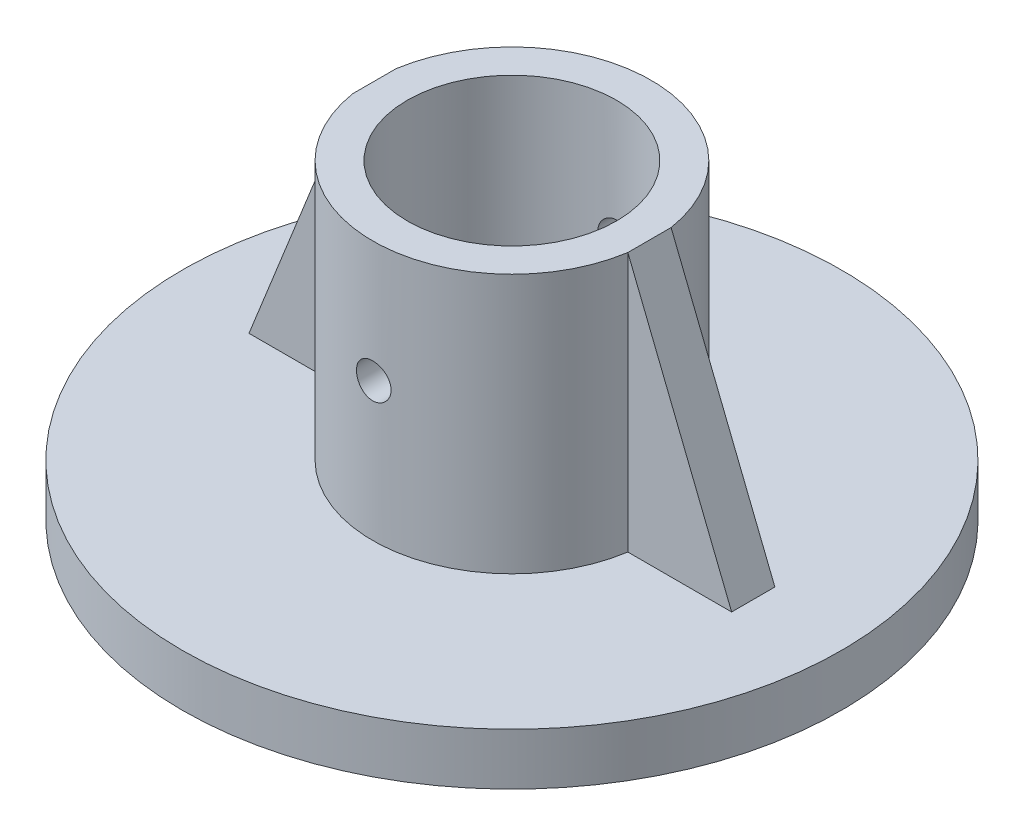
ISO-10303-21;
HEADER;
FILE_DESCRIPTION(('STEP AP214'),'2;1');
FILE_NAME('part.step','',(''),(''),'','','');
FILE_SCHEMA(('AUTOMOTIVE_DESIGN { 1 0 10303 214 1 1 1 1 }'));
ENDSEC;
DATA;
#1=APPLICATION_CONTEXT('core data for automotive mechanical design processes');
#2=APPLICATION_PROTOCOL_DEFINITION('international standard','automotive_design',2000,#1);
#3=PRODUCT_CONTEXT('',#1,'mechanical');
#4=PRODUCT('Part','Part','',(#3));
#5=PRODUCT_RELATED_PRODUCT_CATEGORY('part','',(#4));
#6=PRODUCT_DEFINITION_FORMATION('','',#4);
#7=PRODUCT_DEFINITION_CONTEXT('part definition',#1,'design');
#8=PRODUCT_DEFINITION('design','',#6,#7);
#9=PRODUCT_DEFINITION_SHAPE('','',#8);
#10=(LENGTH_UNIT() NAMED_UNIT(*) SI_UNIT(.MILLI.,.METRE.));
#11=(NAMED_UNIT(*) PLANE_ANGLE_UNIT() SI_UNIT($,.RADIAN.));
#12=(NAMED_UNIT(*) SI_UNIT($,.STERADIAN.) SOLID_ANGLE_UNIT());
#13=UNCERTAINTY_MEASURE_WITH_UNIT(LENGTH_MEASURE(1.E-05),#10,'distance_accuracy_value','');
#14=(GEOMETRIC_REPRESENTATION_CONTEXT(3) GLOBAL_UNCERTAINTY_ASSIGNED_CONTEXT((#13)) GLOBAL_UNIT_ASSIGNED_CONTEXT((#10,
#11,#12)) REPRESENTATION_CONTEXT('',''));
#15=CARTESIAN_POINT('',(0.,0.,0.));
#16=DIRECTION('',(0.,0.,1.));
#17=DIRECTION('',(1.,0.,0.));
#18=AXIS2_PLACEMENT_3D('',#15,#16,#17);
#19=CARTESIAN_POINT('',(0.,18.,0.));
#20=DIRECTION('',(0.,1.,0.));
#21=DIRECTION('',(0.,0.,1.));
#22=AXIS2_PLACEMENT_3D('',#19,#20,#21);
#23=PLANE('',#22);
#24=DIRECTION('',(0.,0.,1.));
#25=VECTOR('',#24,1.);
#26=CARTESIAN_POINT('',(-7.95235814082842,18.,-19.0545648626759));
#27=LINE('',#26,#25);
#28=CARTESIAN_POINT('',(-7.95235814082842,18.,-1.25));
#29=VERTEX_POINT('',#28);
#30=CARTESIAN_POINT('',(-7.95235814082842,18.,1.25));
#31=VERTEX_POINT('',#30);
#32=EDGE_CURVE('E116',#29,#31,#27,.T.);
#33=ORIENTED_EDGE('',*,*,#32,.T.);
#34=CARTESIAN_POINT('',(0.,18.,0.));
#35=DIRECTION('',(0.,1.,0.));
#36=DIRECTION('',(0.,0.,1.));
#37=AXIS2_PLACEMENT_3D('',#34,#35,#36);
#38=CIRCLE('',#37,8.05);
#39=CARTESIAN_POINT('',(7.95235814082842,18.,1.25));
#40=VERTEX_POINT('',#39);
#41=EDGE_CURVE('E126',#31,#40,#38,.T.);
#42=ORIENTED_EDGE('',*,*,#41,.T.);
#43=DIRECTION('',(0.,0.,1.));
#44=VECTOR('',#43,1.);
#45=CARTESIAN_POINT('',(7.95235814082842,18.,-19.0545648626759));
#46=LINE('',#45,#44);
#47=CARTESIAN_POINT('',(7.95235814082842,18.,-1.25));
#48=VERTEX_POINT('',#47);
#49=EDGE_CURVE('E108',#48,#40,#46,.T.);
#50=ORIENTED_EDGE('',*,*,#49,.F.);
#51=EDGE_CURVE('E124',#48,#29,#38,.T.);
#52=ORIENTED_EDGE('',*,*,#51,.T.);
#53=EDGE_LOOP('',(#33,#42,#50,#52));
#54=FACE_BOUND('',#53,.T.);
#55=CARTESIAN_POINT('',(0.,18.,0.));
#56=DIRECTION('',(0.,1.,0.));
#57=DIRECTION('',(0.,0.,1.));
#58=AXIS2_PLACEMENT_3D('',#55,#56,#57);
#59=CIRCLE('',#58,6.05);
#60=CARTESIAN_POINT('',(0.,18.,6.05));
#61=VERTEX_POINT('',#60);
#62=EDGE_CURVE('E140',#61,#61,#59,.T.);
#63=ORIENTED_EDGE('',*,*,#62,.F.);
#64=EDGE_LOOP('',(#63));
#65=FACE_BOUND('',#64,.T.);
#66=ADVANCED_FACE('F42',(#54,#65),#23,.T.);
#67=CARTESIAN_POINT('',(0.,24.5,-1.25));
#68=DIRECTION('',(0.,0.,-1.));
#69=DIRECTION('',(-1.,0.,0.));
#70=AXIS2_PLACEMENT_3D('',#67,#68,#69);
#71=PLANE('',#70);
#72=DIRECTION('',(0.,-1.,0.));
#73=VECTOR('',#72,1.);
#74=CARTESIAN_POINT('',(7.95235814082842,24.5,-1.25));
#75=LINE('',#74,#73);
#76=CARTESIAN_POINT('',(7.95235814082842,3.,-1.25));
#77=VERTEX_POINT('',#76);
#78=EDGE_CURVE('E130',#48,#77,#75,.T.);
#79=ORIENTED_EDGE('',*,*,#78,.F.);
#80=DIRECTION('',(0.371390676354104,-0.928476690885259,0.));
#81=VECTOR('',#80,1.);
#82=CARTESIAN_POINT('',(4.61410184554174,26.3456407382167,-1.25));
#83=LINE('',#82,#81);
#84=CARTESIAN_POINT('',(13.9523581408284,3.,-1.25));
#85=VERTEX_POINT('',#84);
#86=EDGE_CURVE('E105',#48,#85,#83,.T.);
#87=ORIENTED_EDGE('',*,*,#86,.T.);
#88=DIRECTION('',(-1.,0.,0.));
#89=VECTOR('',#88,1.);
#90=CARTESIAN_POINT('',(0.,3.,-1.25));
#91=LINE('',#90,#89);
#92=EDGE_CURVE('E132',#85,#77,#91,.T.);
#93=ORIENTED_EDGE('',*,*,#92,.T.);
#94=EDGE_LOOP('',(#79,#87,#93));
#95=FACE_BOUND('',#94,.T.);
#96=ADVANCED_FACE('F131',(#95),#71,.T.);
#97=CARTESIAN_POINT('',(0.,24.5,1.25));
#98=DIRECTION('',(0.,0.,-1.));
#99=DIRECTION('',(-1.,0.,0.));
#100=AXIS2_PLACEMENT_3D('',#97,#98,#99);
#101=PLANE('',#100);
#102=DIRECTION('',(0.371390676354104,-0.928476690885259,0.));
#103=VECTOR('',#102,1.);
#104=CARTESIAN_POINT('',(4.61410184554174,26.3456407382167,1.25));
#105=LINE('',#104,#103);
#106=CARTESIAN_POINT('',(13.9523581408284,3.,1.25));
#107=VERTEX_POINT('',#106);
#108=EDGE_CURVE('E56',#40,#107,#105,.T.);
#109=ORIENTED_EDGE('',*,*,#108,.F.);
#110=DIRECTION('',(0.,-1.,0.));
#111=VECTOR('',#110,1.);
#112=CARTESIAN_POINT('',(7.95235814082842,24.5,1.25));
#113=LINE('',#112,#111);
#114=CARTESIAN_POINT('',(7.95235814082842,3.,1.25));
#115=VERTEX_POINT('',#114);
#116=EDGE_CURVE('E137',#40,#115,#113,.T.);
#117=ORIENTED_EDGE('',*,*,#116,.T.);
#118=DIRECTION('',(-1.,0.,0.));
#119=VECTOR('',#118,1.);
#120=CARTESIAN_POINT('',(0.,3.,1.25));
#121=LINE('',#120,#119);
#122=EDGE_CURVE('E136',#107,#115,#121,.T.);
#123=ORIENTED_EDGE('',*,*,#122,.F.);
#124=EDGE_LOOP('',(#109,#117,#123));
#125=FACE_BOUND('',#124,.T.);
#126=ADVANCED_FACE('F209',(#125),#101,.F.);
#127=CARTESIAN_POINT('',(0.,55.7688383542068,0.));
#128=DIRECTION('',(0.,-1.,0.));
#129=DIRECTION('',(0.,0.,-1.));
#130=AXIS2_PLACEMENT_3D('',#127,#128,#129);
#131=CYLINDRICAL_SURFACE('',#130,8.05);
#132=CARTESIAN_POINT('',(1.,11.,7.98764671226764));
#133=CARTESIAN_POINT('',(0.999997620110058,10.9440625585666,7.98764751142099));
#134=CARTESIAN_POINT('',(0.995290667624144,10.8880900865312,7.98824065086067));
#135=CARTESIAN_POINT('',(0.976588011379613,10.7777026643398,7.99054824251607));
#136=CARTESIAN_POINT('',(0.962582583011925,10.7232894070692,7.99226386863278));
#137=CARTESIAN_POINT('',(0.925702058934612,10.6176346383622,7.99661917909102));
#138=CARTESIAN_POINT('',(0.902832961017265,10.5663910092605,7.99925823845451));
#139=CARTESIAN_POINT('',(0.848887059024089,10.4684784445207,8.00516230628849));
#140=CARTESIAN_POINT('',(0.817811665841814,10.421808724388,8.00842720713276));
#141=CARTESIAN_POINT('',(0.748151226454924,10.3341011285354,8.01523530225148));
#142=CARTESIAN_POINT('',(0.709529859378422,10.2930921974186,8.01877979098946));
#143=CARTESIAN_POINT('',(0.625951956793985,10.2181202694894,8.02573604217654));
#144=CARTESIAN_POINT('',(0.580995107189892,10.1841576222193,8.02914779803439));
#145=CARTESIAN_POINT('',(0.485840632590397,10.124138640017,8.03546740139074));
#146=CARTESIAN_POINT('',(0.43562637570408,10.0981084812594,8.03837356725736));
#147=CARTESIAN_POINT('',(0.331497069013085,10.0548610315566,8.04334032217134));
#148=CARTESIAN_POINT('',(0.277582155015383,10.0376434174038,8.04540094222925));
#149=CARTESIAN_POINT('',(0.167877889021471,10.0125962295255,8.0484353140976));
#150=CARTESIAN_POINT('',(0.112099676407008,10.0047185516232,8.04941463320322));
#151=CARTESIAN_POINT('',(4.93524431227404E-06,9.99842578106767,8.05019506877789));
#152=CARTESIAN_POINT('',(-0.05631157228931,10.0000103205111,8.04999623105522));
#153=CARTESIAN_POINT('',(-0.167557023432342,10.0125584366752,8.04844726302329));
#154=CARTESIAN_POINT('',(-0.222491903403478,10.0234702787157,8.04710348336455));
#155=CARTESIAN_POINT('',(-0.329744639416305,10.0542823904807,8.04342276039822));
#156=CARTESIAN_POINT('',(-0.382062446207221,10.0741828292912,8.04108579840774));
#157=CARTESIAN_POINT('',(-0.482756184935555,10.1224623088409,8.03567036595514));
#158=CARTESIAN_POINT('',(-0.531121264537595,10.1508637554421,8.03258994017418));
#159=CARTESIAN_POINT('',(-0.622418257752181,10.2153227391226,8.02603224767354));
#160=CARTESIAN_POINT('',(-0.665349925121179,10.2513806229952,8.02255496298169));
#161=CARTESIAN_POINT('',(-0.744865326952247,10.3304187273233,8.01556503478081));
#162=CARTESIAN_POINT('',(-0.781404255539043,10.3734440318284,8.01205231103564));
#163=CARTESIAN_POINT('',(-0.846748788779326,10.4650407232105,8.00541058628276));
#164=CARTESIAN_POINT('',(-0.875554369730243,10.5136121270856,8.00228158645116));
#165=CARTESIAN_POINT('',(-0.92461699250873,10.6149619914103,7.99676160585459));
#166=CARTESIAN_POINT('',(-0.944870472846248,10.6677421937419,7.99437093267406));
#167=CARTESIAN_POINT('',(-0.976214382433026,10.7759908030576,7.9906042935881));
#168=CARTESIAN_POINT('',(-0.987305247621132,10.8314590820154,7.98922827940757));
#169=CARTESIAN_POINT('',(-0.999949817037825,10.9431136621004,7.98765556257974));
#170=CARTESIAN_POINT('',(-1.00156656432588,10.9992927181541,7.98745106458655));
#171=CARTESIAN_POINT('',(-0.995383318532929,11.1111208922151,7.98822391870844));
#172=CARTESIAN_POINT('',(-0.987583523617133,11.1667700213495,7.98920124595274));
#173=CARTESIAN_POINT('',(-0.962841670082377,11.2757699167779,7.99222051740527));
#174=CARTESIAN_POINT('',(-0.945930113677413,11.3291277136581,7.9942589088653));
#175=CARTESIAN_POINT('',(-0.903476184185001,11.4322502118468,7.99916775177299));
#176=CARTESIAN_POINT('',(-0.877933511416778,11.4820147883222,8.0020382321111));
#177=CARTESIAN_POINT('',(-0.818787308285048,11.5768235112517,8.0083065002568));
#178=CARTESIAN_POINT('',(-0.785142420953041,11.6218416776684,8.01170696081658));
#179=CARTESIAN_POINT('',(-0.710805334508952,11.7056146541729,8.01864363780264));
#180=CARTESIAN_POINT('',(-0.670112864736718,11.7443692235989,8.02217985943872));
#181=CARTESIAN_POINT('',(-0.582560392102647,11.8147362277207,8.02901354574018));
#182=CARTESIAN_POINT('',(-0.535666973367803,11.8463072470442,8.03230955497102));
#183=CARTESIAN_POINT('',(-0.437206329066466,11.9011244504532,8.0382696983906));
#184=CARTESIAN_POINT('',(-0.385639196733455,11.9243708005574,8.04093384518021));
#185=CARTESIAN_POINT('',(-0.279432787704706,11.9618103356905,8.04532362162453));
#186=CARTESIAN_POINT('',(-0.22480206853733,11.976027493034,8.04705173461682));
#187=CARTESIAN_POINT('',(-0.113906035208622,11.9950830620807,8.0493850394267));
#188=CARTESIAN_POINT('',(-0.0576407939118787,11.9999218912066,8.04999028122246));
#189=CARTESIAN_POINT('',(0.0545226460470394,12.0000757132958,8.05000942109382));
#190=CARTESIAN_POINT('',(0.110420766515582,11.9954545818967,8.04943130942255));
#191=CARTESIAN_POINT('',(0.220639406436572,11.976954899394,8.04716457796979));
#192=CARTESIAN_POINT('',(0.274959926891975,11.9630763541759,8.04547595889432));
#193=CARTESIAN_POINT('',(0.380473302580579,11.9264757837459,8.0411771199888));
#194=CARTESIAN_POINT('',(0.431667218861148,11.9037567781518,8.03856721486875));
#195=CARTESIAN_POINT('',(0.529525967528423,11.8501268150332,8.03271486403958));
#196=CARTESIAN_POINT('',(0.576190748767486,11.8192157650104,8.02947241118832));
#197=CARTESIAN_POINT('',(0.663992961472377,11.7498427092982,8.0226908227403));
#198=CARTESIAN_POINT('',(0.705092700715495,11.7113331699035,8.01914990430044));
#199=CARTESIAN_POINT('',(0.780271730239304,11.6279548899434,8.01218480336995));
#200=CARTESIAN_POINT('',(0.814349354635883,11.5830846446544,8.00876064874007));
#201=CARTESIAN_POINT('',(0.874627744502778,11.4880625966281,8.00240284410622));
#202=CARTESIAN_POINT('',(0.900797967830979,11.4378913002581,7.99947111495631));
#203=CARTESIAN_POINT('',(0.944304555315926,11.3338578106531,7.99445262799383));
#204=CARTESIAN_POINT('',(0.96165053959345,11.2799997097633,7.99236495051438));
#205=CARTESIAN_POINT('',(0.982857552379819,11.1882182913854,7.9897785160297));
#206=CARTESIAN_POINT('',(0.989276741568364,11.1508741819123,7.98898306413836));
#207=CARTESIAN_POINT('',(0.997848754733346,11.0756920599424,7.98791689381166));
#208=CARTESIAN_POINT('',(1.00000161052192,11.0378540511304,7.98764617146364));
#209=CARTESIAN_POINT('',(1.,11.,7.98764671226764));
#210=B_SPLINE_CURVE_WITH_KNOTS('',3,(#132,#133,#134,#135,#136,#137,#138,#139,#140,#141,#142,
#143,#144,#145,#146,#147,#148,#149,#150,#151,#152,#153,#154,#155,#156,#157,#158,#159,#160,#161,
#162,#163,#164,#165,#166,#167,#168,#169,#170,#171,#172,#173,#174,#175,#176,#177,#178,#179,#180,
#181,#182,#183,#184,#185,#186,#187,#188,#189,#190,#191,#192,#193,#194,#195,#196,#197,#198,#199,
#200,#201,#202,#203,#204,#205,#206,#207,#208,#209),.UNSPECIFIED.,.T.,.F.,(4,2,2,2,2,2,2,2,2,2,2,
2,2,2,2,2,2,2,2,2,2,2,2,2,2,2,2,2,2,2,2,2,2,2,2,2,2,2,4),(0.,0.167674038739997,
0.335523712545188,0.503260005004049,0.670967477618765,0.839502995266496,1.00804687139266,
1.17714104359445,1.34622901368077,1.51444228094254,1.68264900789584,1.84992877117758,
2.01721168131848,2.18493943590292,2.3526747892295,2.52154238655544,2.69041050145155,
2.85934887164521,3.02827920362719,3.19608414457539,3.36388555423576,3.53112869650374,
3.69837764621343,3.86649910518978,4.03462702224937,4.20370098376814,4.37277157326038,
4.54139138645449,4.71000369432571,4.87748125233151,5.04495870386168,5.21237900060544,
5.37980118781122,5.54830596412681,5.71685066959207,5.88603828925734,6.05504106440689,
6.16851048312521,6.2819790557497),.UNSPECIFIED.);
#211=CARTESIAN_POINT('',(1.,11.,7.98764671226764));
#212=VERTEX_POINT('',#211);
#213=EDGE_CURVE('E127',#212,#212,#210,.T.);
#214=ORIENTED_EDGE('',*,*,#213,.T.);
#215=EDGE_LOOP('',(#214));
#216=FACE_BOUND('',#215,.T.);
#217=ORIENTED_EDGE('',*,*,#116,.F.);
#218=ORIENTED_EDGE('',*,*,#41,.F.);
#219=DIRECTION('',(0.,-1.,0.));
#220=VECTOR('',#219,1.);
#221=CARTESIAN_POINT('',(-7.95235814082842,24.5,1.25));
#222=LINE('',#221,#220);
#223=CARTESIAN_POINT('',(-7.95235814082842,3.,1.25));
#224=VERTEX_POINT('',#223);
#225=EDGE_CURVE('E236',#31,#224,#222,.T.);
#226=ORIENTED_EDGE('',*,*,#225,.T.);
#227=CARTESIAN_POINT('',(0.,3.,0.));
#228=DIRECTION('',(0.,1.,0.));
#229=DIRECTION('',(0.,0.,1.));
#230=AXIS2_PLACEMENT_3D('',#227,#228,#229);
#231=CIRCLE('',#230,8.05);
#232=EDGE_CURVE('E72',#115,#224,#231,.F.);
#233=ORIENTED_EDGE('',*,*,#232,.F.);
#234=EDGE_LOOP('',(#217,#218,#226,#233));
#235=FACE_BOUND('',#234,.T.);
#236=ADVANCED_FACE('F195',(#216,#235),#131,.T.);
#237=CARTESIAN_POINT('',(0.,3.,0.));
#238=DIRECTION('',(0.,-1.,0.));
#239=DIRECTION('',(0.,0.,-1.));
#240=AXIS2_PLACEMENT_3D('',#237,#238,#239);
#241=CYLINDRICAL_SURFACE('',#240,19.0545648626759);
#242=CARTESIAN_POINT('',(0.,3.,0.));
#243=DIRECTION('',(0.,1.,0.));
#244=DIRECTION('',(0.,0.,1.));
#245=AXIS2_PLACEMENT_3D('',#242,#243,#244);
#246=CIRCLE('',#245,19.0545648626759);
#247=CARTESIAN_POINT('',(0.,3.,19.0545648626759));
#248=VERTEX_POINT('',#247);
#249=EDGE_CURVE('E151',#248,#248,#246,.T.);
#250=ORIENTED_EDGE('',*,*,#249,.F.);
#251=EDGE_LOOP('',(#250));
#252=FACE_BOUND('',#251,.T.);
#253=CARTESIAN_POINT('',(0.,0.,0.));
#254=DIRECTION('',(0.,1.,0.));
#255=DIRECTION('',(0.,0.,1.));
#256=AXIS2_PLACEMENT_3D('',#253,#254,#255);
#257=CIRCLE('',#256,19.0545648626759);
#258=CARTESIAN_POINT('',(0.,0.,19.0545648626759));
#259=VERTEX_POINT('',#258);
#260=EDGE_CURVE('E154',#259,#259,#257,.T.);
#261=ORIENTED_EDGE('',*,*,#260,.T.);
#262=EDGE_LOOP('',(#261));
#263=FACE_BOUND('',#262,.T.);
#264=ADVANCED_FACE('F44',(#252,#263),#241,.T.);
#265=CARTESIAN_POINT('',(0.,3.,0.));
#266=DIRECTION('',(0.,1.,0.));
#267=DIRECTION('',(0.,0.,1.));
#268=AXIS2_PLACEMENT_3D('',#265,#266,#267);
#269=PLANE('',#268);
#270=DIRECTION('',(0.,0.,-1.));
#271=VECTOR('',#270,1.);
#272=CARTESIAN_POINT('',(-13.9523581408284,3.,0.));
#273=LINE('',#272,#271);
#274=CARTESIAN_POINT('',(-13.9523581408284,3.,1.25));
#275=VERTEX_POINT('',#274);
#276=CARTESIAN_POINT('',(-13.9523581408284,3.,-1.25));
#277=VERTEX_POINT('',#276);
#278=EDGE_CURVE('E143',#275,#277,#273,.T.);
#279=ORIENTED_EDGE('',*,*,#278,.T.);
#280=DIRECTION('',(-1.,0.,0.));
#281=VECTOR('',#280,1.);
#282=CARTESIAN_POINT('',(0.,3.,-1.25));
#283=LINE('',#282,#281);
#284=CARTESIAN_POINT('',(-7.95235814082842,3.,-1.25));
#285=VERTEX_POINT('',#284);
#286=EDGE_CURVE('E230',#285,#277,#283,.T.);
#287=ORIENTED_EDGE('',*,*,#286,.F.);
#288=EDGE_CURVE('E152',#285,#77,#231,.F.);
#289=ORIENTED_EDGE('',*,*,#288,.T.);
#290=ORIENTED_EDGE('',*,*,#92,.F.);
#291=DIRECTION('',(0.,0.,-1.));
#292=VECTOR('',#291,1.);
#293=CARTESIAN_POINT('',(13.9523581408284,3.,0.));
#294=LINE('',#293,#292);
#295=EDGE_CURVE('E111',#107,#85,#294,.T.);
#296=ORIENTED_EDGE('',*,*,#295,.F.);
#297=ORIENTED_EDGE('',*,*,#122,.T.);
#298=ORIENTED_EDGE('',*,*,#232,.T.);
#299=DIRECTION('',(-1.,0.,0.));
#300=VECTOR('',#299,1.);
#301=CARTESIAN_POINT('',(0.,3.,1.25));
#302=LINE('',#301,#300);
#303=EDGE_CURVE('E231',#224,#275,#302,.T.);
#304=ORIENTED_EDGE('',*,*,#303,.T.);
#305=EDGE_LOOP('',(#279,#287,#289,#290,#296,#297,#298,#304));
#306=FACE_BOUND('',#305,.T.);
#307=ORIENTED_EDGE('',*,*,#249,.T.);
#308=EDGE_LOOP('',(#307));
#309=FACE_BOUND('',#308,.T.);
#310=ADVANCED_FACE('F196',(#306,#309),#269,.T.);
#311=CARTESIAN_POINT('',(0.,0.,0.));
#312=DIRECTION('',(0.,1.,0.));
#313=DIRECTION('',(0.,0.,1.));
#314=AXIS2_PLACEMENT_3D('',#311,#312,#313);
#315=PLANE('',#314);
#316=ORIENTED_EDGE('',*,*,#260,.F.);
#317=EDGE_LOOP('',(#316));
#318=FACE_BOUND('',#317,.T.);
#319=ADVANCED_FACE('F193',(#318),#315,.F.);
#320=CARTESIAN_POINT('',(1.,11.,-7.98764671226764));
#321=CARTESIAN_POINT('',(0.999997620110058,11.0559374414334,-7.98764751142099));
#322=CARTESIAN_POINT('',(0.995290667624144,11.1119099134688,-7.98824065086067));
#323=CARTESIAN_POINT('',(0.976588011379613,11.2222973356602,-7.99054824251607));
#324=CARTESIAN_POINT('',(0.962582583011926,11.2767105929307,-7.99226386863278));
#325=CARTESIAN_POINT('',(0.925702058934613,11.3823653616378,-7.99661917909102));
#326=CARTESIAN_POINT('',(0.902832961017266,11.4336089907395,-7.99925823845451));
#327=CARTESIAN_POINT('',(0.84888705902409,11.5315215554793,-8.00516230628849));
#328=CARTESIAN_POINT('',(0.817811665841815,11.578191275612,-8.00842720713276));
#329=CARTESIAN_POINT('',(0.748151226454924,11.6658988714646,-8.01523530225148));
#330=CARTESIAN_POINT('',(0.709529859378422,11.7069078025814,-8.01877979098946));
#331=CARTESIAN_POINT('',(0.625951956793985,11.7818797305106,-8.02573604217654));
#332=CARTESIAN_POINT('',(0.580995107189892,11.8158423777807,-8.02914779803439));
#333=CARTESIAN_POINT('',(0.485840632590397,11.875861359983,-8.03546740139074));
#334=CARTESIAN_POINT('',(0.43562637570408,11.9018915187406,-8.03837356725736));
#335=CARTESIAN_POINT('',(0.331497069013085,11.9451389684434,-8.04334032217134));
#336=CARTESIAN_POINT('',(0.277582155015383,11.9623565825962,-8.04540094222925));
#337=CARTESIAN_POINT('',(0.167877889021471,11.9874037704745,-8.0484353140976));
#338=CARTESIAN_POINT('',(0.112099676407008,11.9952814483768,-8.04941463320322));
#339=CARTESIAN_POINT('',(4.93524431227404E-06,12.0015742189323,-8.05019506877789));
#340=CARTESIAN_POINT('',(-0.05631157228931,11.9999896794889,-8.04999623105522));
#341=CARTESIAN_POINT('',(-0.167557023432342,11.9874415633248,-8.04844726302329));
#342=CARTESIAN_POINT('',(-0.222491903403478,11.9765297212843,-8.04710348336455));
#343=CARTESIAN_POINT('',(-0.329744639416305,11.9457176095193,-8.04342276039822));
#344=CARTESIAN_POINT('',(-0.382062446207221,11.9258171707088,-8.04108579840774));
#345=CARTESIAN_POINT('',(-0.482756184935555,11.8775376911591,-8.03567036595514));
#346=CARTESIAN_POINT('',(-0.531121264537595,11.8491362445579,-8.03258994017418));
#347=CARTESIAN_POINT('',(-0.622418257752181,11.7846772608774,-8.02603224767354));
#348=CARTESIAN_POINT('',(-0.665349925121179,11.7486193770048,-8.02255496298169));
#349=CARTESIAN_POINT('',(-0.744865326952247,11.6695812726767,-8.01556503478081));
#350=CARTESIAN_POINT('',(-0.781404255539043,11.6265559681716,-8.01205231103564));
#351=CARTESIAN_POINT('',(-0.846748788779326,11.5349592767895,-8.00541058628276));
#352=CARTESIAN_POINT('',(-0.875554369730243,11.4863878729144,-8.00228158645116));
#353=CARTESIAN_POINT('',(-0.92461699250873,11.3850380085897,-7.99676160585459));
#354=CARTESIAN_POINT('',(-0.944870472846248,11.3322578062581,-7.99437093267406));
#355=CARTESIAN_POINT('',(-0.976214382433026,11.2240091969424,-7.9906042935881));
#356=CARTESIAN_POINT('',(-0.987305247621132,11.1685409179846,-7.98922827940757));
#357=CARTESIAN_POINT('',(-0.999949817037825,11.0568863378996,-7.98765556257974));
#358=CARTESIAN_POINT('',(-1.00156656432588,11.0007072818459,-7.98745106458655));
#359=CARTESIAN_POINT('',(-0.995383318532929,10.8888791077849,-7.98822391870844));
#360=CARTESIAN_POINT('',(-0.987583523617133,10.8332299786505,-7.98920124595274));
#361=CARTESIAN_POINT('',(-0.962841670082377,10.7242300832221,-7.99222051740527));
#362=CARTESIAN_POINT('',(-0.945930113677413,10.6708722863419,-7.9942589088653));
#363=CARTESIAN_POINT('',(-0.903476184185001,10.5677497881532,-7.99916775177299));
#364=CARTESIAN_POINT('',(-0.877933511416778,10.5179852116778,-8.0020382321111));
#365=CARTESIAN_POINT('',(-0.818787308285048,10.4231764887483,-8.0083065002568));
#366=CARTESIAN_POINT('',(-0.785142420953041,10.3781583223316,-8.01170696081658));
#367=CARTESIAN_POINT('',(-0.710805334508952,10.2943853458271,-8.01864363780264));
#368=CARTESIAN_POINT('',(-0.670112864736718,10.2556307764011,-8.02217985943872));
#369=CARTESIAN_POINT('',(-0.582560392102647,10.1852637722793,-8.02901354574018));
#370=CARTESIAN_POINT('',(-0.535666973367803,10.1536927529558,-8.03230955497102));
#371=CARTESIAN_POINT('',(-0.437206329066466,10.0988755495468,-8.0382696983906));
#372=CARTESIAN_POINT('',(-0.385639196733455,10.0756291994426,-8.04093384518021));
#373=CARTESIAN_POINT('',(-0.279432787704706,10.0381896643095,-8.04532362162453));
#374=CARTESIAN_POINT('',(-0.22480206853733,10.023972506966,-8.04705173461682));
#375=CARTESIAN_POINT('',(-0.113906035208622,10.0049169379193,-8.0493850394267));
#376=CARTESIAN_POINT('',(-0.0576407939118787,10.0000781087934,-8.04999028122246));
#377=CARTESIAN_POINT('',(0.0545226460470394,9.99992428670418,-8.05000942109382));
#378=CARTESIAN_POINT('',(0.110420766515582,10.0045454181033,-8.04943130942255));
#379=CARTESIAN_POINT('',(0.220639406436572,10.023045100606,-8.04716457796979));
#380=CARTESIAN_POINT('',(0.274959926891975,10.0369236458241,-8.04547595889432));
#381=CARTESIAN_POINT('',(0.380473302580579,10.0735242162541,-8.0411771199888));
#382=CARTESIAN_POINT('',(0.431667218861148,10.0962432218482,-8.03856721486875));
#383=CARTESIAN_POINT('',(0.529525967528423,10.1498731849668,-8.03271486403958));
#384=CARTESIAN_POINT('',(0.576190748767486,10.1807842349896,-8.02947241118832));
#385=CARTESIAN_POINT('',(0.663992961472377,10.2501572907018,-8.0226908227403));
#386=CARTESIAN_POINT('',(0.705092700715495,10.2886668300965,-8.01914990430044));
#387=CARTESIAN_POINT('',(0.780271730239304,10.3720451100566,-8.01218480336995));
#388=CARTESIAN_POINT('',(0.814349354635883,10.4169153553456,-8.00876064874007));
#389=CARTESIAN_POINT('',(0.874627744502777,10.5119374033719,-8.00240284410622));
#390=CARTESIAN_POINT('',(0.900797967830979,10.5621086997419,-7.99947111495631));
#391=CARTESIAN_POINT('',(0.944304555315926,10.6661421893469,-7.99445262799383));
#392=CARTESIAN_POINT('',(0.96165053959345,10.7200002902367,-7.99236495051438));
#393=CARTESIAN_POINT('',(0.982857552379819,10.8117817086146,-7.9897785160297));
#394=CARTESIAN_POINT('',(0.989276741568364,10.8491258180877,-7.98898306413836));
#395=CARTESIAN_POINT('',(0.997848754733346,10.9243079400576,-7.98791689381166));
#396=CARTESIAN_POINT('',(1.00000161052192,10.9621459488696,-7.98764617146364));
#397=CARTESIAN_POINT('',(1.,11.,-7.98764671226764));
#398=B_SPLINE_CURVE_WITH_KNOTS('',3,(#320,#321,#322,#323,#324,#325,#326,#327,#328,#329,#330,
#331,#332,#333,#334,#335,#336,#337,#338,#339,#340,#341,#342,#343,#344,#345,#346,#347,#348,#349,
#350,#351,#352,#353,#354,#355,#356,#357,#358,#359,#360,#361,#362,#363,#364,#365,#366,#367,#368,
#369,#370,#371,#372,#373,#374,#375,#376,#377,#378,#379,#380,#381,#382,#383,#384,#385,#386,#387,
#388,#389,#390,#391,#392,#393,#394,#395,#396,#397),.UNSPECIFIED.,.T.,.F.,(4,2,2,2,2,2,2,2,2,2,2,
2,2,2,2,2,2,2,2,2,2,2,2,2,2,2,2,2,2,2,2,2,2,2,2,2,2,2,4),(0.,0.167674038739997,
0.335523712545188,0.503260005004043,0.670967477618764,0.839502995266496,1.00804687139266,
1.17714104359445,1.34622901368077,1.51444228094254,1.68264900789584,1.84992877117758,
2.01721168131848,2.18493943590292,2.3526747892295,2.52154238655544,2.69041050145155,
2.85934887164521,3.02827920362719,3.19608414457539,3.36388555423576,3.53112869650374,
3.69837764621343,3.86649910518978,4.03462702224937,4.20370098376814,4.37277157326038,
4.54139138645449,4.71000369432571,4.87748125233151,5.04495870386168,5.21237900060544,
5.37980118781122,5.54830596412681,5.71685066959207,5.88603828925734,6.05504106440689,
6.16851048312521,6.2819790557497),.UNSPECIFIED.);
#399=CARTESIAN_POINT('',(1.,11.,-7.98764671226764));
#400=VERTEX_POINT('',#399);
#401=EDGE_CURVE('E181',#400,#400,#398,.T.);
#402=ORIENTED_EDGE('',*,*,#401,.T.);
#403=EDGE_LOOP('',(#402));
#404=FACE_BOUND('',#403,.T.);
#405=ORIENTED_EDGE('',*,*,#51,.F.);
#406=ORIENTED_EDGE('',*,*,#78,.T.);
#407=ORIENTED_EDGE('',*,*,#288,.F.);
#408=DIRECTION('',(0.,-1.,0.));
#409=VECTOR('',#408,1.);
#410=CARTESIAN_POINT('',(-7.95235814082842,24.5,-1.25));
#411=LINE('',#410,#409);
#412=EDGE_CURVE('E64',#29,#285,#411,.T.);
#413=ORIENTED_EDGE('',*,*,#412,.F.);
#414=EDGE_LOOP('',(#405,#406,#407,#413));
#415=FACE_BOUND('',#414,.T.);
#416=ADVANCED_FACE('F139',(#404,#415),#131,.T.);
#417=CARTESIAN_POINT('',(0.,55.7688383542068,0.));
#418=DIRECTION('',(0.,-1.,0.));
#419=DIRECTION('',(0.,0.,-1.));
#420=AXIS2_PLACEMENT_3D('',#417,#418,#419);
#421=CYLINDRICAL_SURFACE('',#420,6.05);
#422=CARTESIAN_POINT('',(0.,12.,-6.05));
#423=CARTESIAN_POINT('',(-0.055763107330207,11.9999977582576,-6.04999904910503));
#424=CARTESIAN_POINT('',(-0.111556814214892,11.9953199584959,-6.04922100889129));
#425=CARTESIAN_POINT('',(-0.22157984853293,11.9767398712399,-6.04619217042806));
#426=CARTESIAN_POINT('',(-0.275807681714577,11.9628290580688,-6.04394001101758));
#427=CARTESIAN_POINT('',(-0.381091203557549,11.9262140483539,-6.03821558535461));
#428=CARTESIAN_POINT('',(-0.432149431061133,11.9035169978241,-6.03474431084391));
#429=CARTESIAN_POINT('',(-0.529726226769975,11.8499924029863,-6.02696349601993));
#430=CARTESIAN_POINT('',(-0.576245322879726,11.8191658056988,-6.02265405336118));
#431=CARTESIAN_POINT('',(-0.663867684054409,11.749948576967,-6.01362942275649));
#432=CARTESIAN_POINT('',(-0.704922042983904,11.7114964341207,-6.00891112359366));
#433=CARTESIAN_POINT('',(-0.7800271370338,11.6282520246561,-5.99962442140613));
#434=CARTESIAN_POINT('',(-0.814077433538232,11.5834593612713,-5.99505602778403));
#435=CARTESIAN_POINT('',(-0.874403348398625,11.4884700949805,-5.98655624787904));
#436=CARTESIAN_POINT('',(-0.900630695835967,11.4382424450154,-5.98262888167268));
#437=CARTESIAN_POINT('',(-0.944257546389287,11.3340187632372,-5.97589892812823));
#438=CARTESIAN_POINT('',(-0.961657635738232,11.2800229819429,-5.97309626609925));
#439=CARTESIAN_POINT('',(-0.986982147519561,11.1703138451571,-5.96896398237221));
#440=CARTESIAN_POINT('',(-0.994990941996258,11.114620468567,-5.96762125262582));
#441=CARTESIAN_POINT('',(-1.00156710052215,11.0026654338863,-5.96652119630863));
#442=CARTESIAN_POINT('',(-1.00013512177193,10.946403815625,-5.96676375938083));
#443=CARTESIAN_POINT('',(-0.987939125784481,10.835511109205,-5.96879491287416));
#444=CARTESIAN_POINT('',(-0.977269818635745,10.7808692756187,-5.97056781224413));
#445=CARTESIAN_POINT('',(-0.947050628750768,10.6741620869422,-5.97543531938388));
#446=CARTESIAN_POINT('',(-0.927500446012184,10.6220968189562,-5.9785299718032));
#447=CARTESIAN_POINT('',(-0.879978225898624,10.5217367713066,-5.9857092783777));
#448=CARTESIAN_POINT('',(-0.851966791866128,10.4734609902204,-5.9897985458507));
#449=CARTESIAN_POINT('',(-0.788345189744728,10.3822590601755,-5.99850311053519));
#450=CARTESIAN_POINT('',(-0.752734418230675,10.3393333364671,-6.00311844950581));
#451=CARTESIAN_POINT('',(-0.674408640552469,10.2595017406372,-6.01242410293947));
#452=CARTESIAN_POINT('',(-0.631612359929956,10.2226755899651,-6.01711464574021));
#453=CARTESIAN_POINT('',(-0.540405452512533,10.1567151889954,-6.02599019679899));
#454=CARTESIAN_POINT('',(-0.491994790641909,10.1275809867568,-6.03017520189836));
#455=CARTESIAN_POINT('',(-0.390858869400972,10.0778245140637,-6.03757394247597));
#456=CARTESIAN_POINT('',(-0.338130121367723,10.0572092091204,-6.04078688256865));
#457=CARTESIAN_POINT('',(-0.229893758328505,10.0251493040018,-6.04587307264827));
#458=CARTESIAN_POINT('',(-0.174386372315018,10.0137039494322,-6.04774643283853));
#459=CARTESIAN_POINT('',(-0.0628555893417599,10.0004167305519,-6.04992758651829));
#460=CARTESIAN_POINT('',(-0.00684556899305417,9.99846541118267,-6.05025322243068));
#461=CARTESIAN_POINT('',(0.104701172267124,10.0039299530289,-6.04935108022826));
#462=CARTESIAN_POINT('',(0.160237910999759,10.0113454599586,-6.0481233608667));
#463=CARTESIAN_POINT('',(0.268924085137399,10.0352421191759,-6.0442635027901));
#464=CARTESIAN_POINT('',(0.322085742138858,10.0516691569659,-6.04163975009679));
#465=CARTESIAN_POINT('',(0.424900489602789,10.0930649403564,-6.03528086612182));
#466=CARTESIAN_POINT('',(0.474553385555774,10.1180341590484,-6.03154567328677));
#467=CARTESIAN_POINT('',(0.569417087757421,10.1760567332448,-6.02333408023131));
#468=CARTESIAN_POINT('',(0.614585474919946,10.2091785519795,-6.01885151235287));
#469=CARTESIAN_POINT('',(0.698761953288632,10.2824718423661,-6.00966121925691));
#470=CARTESIAN_POINT('',(0.73776960447645,10.322643817129,-6.00495347798809));
#471=CARTESIAN_POINT('',(0.808922409164897,10.409387677691,-5.99578583327022));
#472=CARTESIAN_POINT('',(0.840993659260368,10.4560205519928,-5.99132894071714));
#473=CARTESIAN_POINT('',(0.896847348003551,10.5540761024765,-5.98322360359426));
#474=CARTESIAN_POINT('',(0.920630046238948,10.6054986285883,-5.97957513370693));
#475=CARTESIAN_POINT('',(0.959120651372527,10.7114659617195,-5.97352225983464));
#476=CARTESIAN_POINT('',(0.973865525131115,10.7659970390971,-5.97111279463287));
#477=CARTESIAN_POINT('',(0.993978374001555,10.8768049923371,-5.96779797630661));
#478=CARTESIAN_POINT('',(0.999347149603212,10.9330817187462,-5.96689249477897));
#479=CARTESIAN_POINT('',(1.00053336072021,11.0450456218682,-5.96669363657234));
#480=CARTESIAN_POINT('',(0.996467112534534,11.1007315656404,-5.96738062756529));
#481=CARTESIAN_POINT('',(0.979150021222707,11.2106154125145,-5.97024631195493));
#482=CARTESIAN_POINT('',(0.965899206463729,11.2648133202118,-5.97242500074441));
#483=CARTESIAN_POINT('',(0.930633390989302,11.3701387329783,-5.97802118812006));
#484=CARTESIAN_POINT('',(0.908628242693069,11.4212696155886,-5.98143729369063));
#485=CARTESIAN_POINT('',(0.856490320794337,11.5191326690091,-5.98912478419959));
#486=CARTESIAN_POINT('',(0.826357154976962,11.5658646274038,-5.99339621040864));
#487=CARTESIAN_POINT('',(0.758402799672187,11.6541912336793,-6.00237537661395));
#488=CARTESIAN_POINT('',(0.720495986801272,11.6957195576836,-6.00708762705439));
#489=CARTESIAN_POINT('',(0.638250961829238,11.7718657821277,-6.01638137020094));
#490=CARTESIAN_POINT('',(0.593911266778899,11.8064820847798,-6.02096283246469));
#491=CARTESIAN_POINT('',(0.499702034016578,11.8680357870681,-6.0295147524091));
#492=CARTESIAN_POINT('',(0.449797036087455,11.8949195223864,-6.03348085604188));
#493=CARTESIAN_POINT('',(0.346134481251576,11.9398810197605,-6.0403127914535));
#494=CARTESIAN_POINT('',(0.292380836520589,11.957967582411,-6.04317972222209));
#495=CARTESIAN_POINT('',(0.198679558254291,11.9808802617986,-6.04686216517462));
#496=CARTESIAN_POINT('',(0.15929980223945,11.9880387262452,-6.04803258503029));
#497=CARTESIAN_POINT('',(0.0799519349721529,11.997599359168,-6.04960183688425));
#498=CARTESIAN_POINT('',(0.0399838335964833,12.000001607397,-6.05000068182044));
#499=CARTESIAN_POINT('',(0.,12.,-6.05));
#500=B_SPLINE_CURVE_WITH_KNOTS('',3,(#422,#423,#424,#425,#426,#427,#428,#429,#430,#431,#432,
#433,#434,#435,#436,#437,#438,#439,#440,#441,#442,#443,#444,#445,#446,#447,#448,#449,#450,#451,
#452,#453,#454,#455,#456,#457,#458,#459,#460,#461,#462,#463,#464,#465,#466,#467,#468,#469,#470,
#471,#472,#473,#474,#475,#476,#477,#478,#479,#480,#481,#482,#483,#484,#485,#486,#487,#488,#489,
#490,#491,#492,#493,#494,#495,#496,#497,#498,#499),.UNSPECIFIED.,.T.,.F.,(4,2,2,2,2,2,2,2,2,2,2,
2,2,2,2,2,2,2,2,2,2,2,2,2,2,2,2,2,2,2,2,2,2,2,2,2,2,2,4),(0.,0.167143173542739,
0.334440900619144,0.501602846183543,0.668745327454361,0.837295331799828,1.00585588805463,
1.17543598427103,1.34500481691494,1.51303826733883,1.68106002057282,1.84737918227397,
2.01370396277346,2.18081543281782,2.3479401772839,2.51710124674214,2.68626337308706,
2.85556354315177,3.02484978378556,3.1921796520081,3.35950319142566,3.52583277567315,
3.69217157324216,3.85995797847763,4.02775636211007,4.19726294911491,4.36676422689586,
4.53556749507661,4.70435635087602,4.87107542816912,5.03779399054114,5.20432545067747,
5.37086494817396,5.53934815116214,5.70787025587466,5.87753514933369,6.04702996101021,
6.16687867860315,6.2867253865376),.UNSPECIFIED.);
#501=CARTESIAN_POINT('',(0.,12.,-6.05));
#502=VERTEX_POINT('',#501);
#503=EDGE_CURVE('E46',#502,#502,#500,.T.);
#504=ORIENTED_EDGE('',*,*,#503,.F.);
#505=EDGE_LOOP('',(#504));
#506=FACE_BOUND('',#505,.T.);
#507=CARTESIAN_POINT('',(1.,11.,5.9667830528686));
#508=CARTESIAN_POINT('',(0.999997753357443,10.9442427581671,5.96678405383097));
#509=CARTESIAN_POINT('',(0.99532090440087,10.8884549020503,5.9675730665021));
#510=CARTESIAN_POINT('',(0.976744936314325,10.7784440200922,5.970641052239));
#511=CARTESIAN_POINT('',(0.962837269945496,10.7242224931897,5.97292140617761));
#512=CARTESIAN_POINT('',(0.926231462263743,10.6189523181343,5.97870690667914));
#513=CARTESIAN_POINT('',(0.903540615481612,10.5679010777436,5.98221103664673));
#514=CARTESIAN_POINT('',(0.850030638645026,10.4703360322675,5.9900480591918));
#515=CARTESIAN_POINT('',(0.819212440881606,10.4238217075889,5.99438085669691));
#516=CARTESIAN_POINT('',(0.750003771406096,10.3361941360309,6.0034339656153));
#517=CARTESIAN_POINT('',(0.711549905500773,10.2951312651022,6.0081573137077));
#518=CARTESIAN_POINT('',(0.628298452579324,10.2200096919661,6.01743233415692));
#519=CARTESIAN_POINT('',(0.583500492254411,10.1859514022222,6.02198399639117));
#520=CARTESIAN_POINT('',(0.488506409112111,10.1256169862004,6.03043489940456));
#521=CARTESIAN_POINT('',(0.43828015055876,10.0993877015341,6.03433015477503));
#522=CARTESIAN_POINT('',(0.334059486278662,10.0557568880236,6.04099557526129));
#523=CARTESIAN_POINT('',(0.280065321820432,10.0383547945411,6.04376581233753));
#524=CARTESIAN_POINT('',(0.170361856041226,10.0130263044346,6.04784762974517));
#525=CARTESIAN_POINT('',(0.114672583670846,10.0050152900281,6.04917222831255));
#526=CARTESIAN_POINT('',(0.0027256383626307,9.99843326873171,6.0502582400039));
#527=CARTESIAN_POINT('',(-0.0535319962970512,9.99986163029347,6.05001975770695));
#528=CARTESIAN_POINT('',(-0.164440271181816,10.0120517567334,6.04801679183549));
#529=CARTESIAN_POINT('',(-0.219101227588323,10.0227224589279,6.04626719738008));
#530=CARTESIAN_POINT('',(-0.32584593570729,10.0529510123264,6.04145519311583));
#531=CARTESIAN_POINT('',(-0.377929609890447,10.0725091306999,6.03839274384071));
#532=CARTESIAN_POINT('',(-0.478312520027575,10.1200480682001,6.03127375905224));
#533=CARTESIAN_POINT('',(-0.526593626498392,10.1480664803117,6.02721280198262));
#534=CARTESIAN_POINT('',(-0.617803277211608,10.2117031313396,6.01854810085255));
#535=CARTESIAN_POINT('',(-0.660731394774538,10.2473219754633,6.01394431358067));
#536=CARTESIAN_POINT('',(-0.74055441001755,10.3256536635944,6.00464122711101));
#537=CARTESIAN_POINT('',(-0.777371199006202,10.3684460896006,5.99994144373554));
#538=CARTESIAN_POINT('',(-0.843314522146176,10.4596418858631,5.99102923405065));
#539=CARTESIAN_POINT('',(-0.872440987604049,10.5080453062338,5.98681681209477));
#540=CARTESIAN_POINT('',(-0.922191812732697,10.6091788927158,5.97935605644002));
#541=CARTESIAN_POINT('',(-0.94280688649495,10.6619137095905,5.97610877678506));
#542=CARTESIAN_POINT('',(-0.974864487215736,10.7701633180265,5.97096352184003));
#543=CARTESIAN_POINT('',(-0.986307807708659,10.8256778686453,5.9690654298207));
#544=CARTESIAN_POINT('',(-0.999587327930032,10.9372125644226,5.96685600513255));
#545=CARTESIAN_POINT('',(-1.00153481889844,10.9932191067974,5.96652629216686));
#546=CARTESIAN_POINT('',(-0.99606386178793,11.1047579871356,5.96744201343164));
#547=CARTESIAN_POINT('',(-0.988645769254934,11.16029034302,5.96868738786702));
#548=CARTESIAN_POINT('',(-0.964749061747759,11.2689517201507,5.97259598813182));
#549=CARTESIAN_POINT('',(-0.948326991610375,11.3220935232241,5.97525036218602));
#550=CARTESIAN_POINT('',(-0.906947753184701,11.4248707472605,5.98167046321571));
#551=CARTESIAN_POINT('',(-0.881990081879891,11.4745059613666,5.98543625568706));
#552=CARTESIAN_POINT('',(-0.823985026531991,11.5693566648854,5.99369764211164));
#553=CARTESIAN_POINT('',(-0.790866261647297,11.6145279421574,5.99819955079356));
#554=CARTESIAN_POINT('',(-0.717577220585988,11.698711663156,6.00740740021147));
#555=CARTESIAN_POINT('',(-0.677406456913043,11.7377236807458,6.01211335503598));
#556=CARTESIAN_POINT('',(-0.590660903781113,11.8088872871671,6.02125713248403));
#557=CARTESIAN_POINT('',(-0.544024867398323,11.8409646965177,6.02569172368777));
#558=CARTESIAN_POINT('',(-0.445961218766559,11.8968291776866,6.03374141184526));
#559=CARTESIAN_POINT('',(-0.394533759596745,11.9206165142459,6.03735653496719));
#560=CARTESIAN_POINT('',(-0.288568441236949,11.9591099140519,6.04334590560083));
#561=CARTESIAN_POINT('',(-0.234045051097266,11.9738549450879,6.04572547084379));
#562=CARTESIAN_POINT('',(-0.123253420960297,11.9939707082557,6.04899808128509));
#563=CARTESIAN_POINT('',(-0.0669853224436251,11.9993421984869,6.04989124669803));
#564=CARTESIAN_POINT('',(0.0449822091256403,12.0005368740519,6.05008876550211));
#565=CARTESIAN_POINT('',(0.10068043654584,11.9964729800904,6.04941190868222));
#566=CARTESIAN_POINT('',(0.210589467419894,11.9791562986171,6.04658375298219));
#567=CARTESIAN_POINT('',(0.264800278868796,11.9659035605066,6.04443246202893));
#568=CARTESIAN_POINT('',(0.37015355327324,11.9306284412937,6.03889628583154));
#569=CARTESIAN_POINT('',(0.421299253933482,11.9086155084686,6.03551272997491));
#570=CARTESIAN_POINT('',(0.519188734235216,11.8564573920521,6.02788158280005));
#571=CARTESIAN_POINT('',(0.565932310637476,11.8263118332381,6.02363395161739));
#572=CARTESIAN_POINT('',(0.654259838374056,11.7583431798375,6.01468534288084));
#573=CARTESIAN_POINT('',(0.695779656100204,11.7204373346938,6.00997979287827));
#574=CARTESIAN_POINT('',(0.771909167407744,11.6381978324505,6.0006775379804));
#575=CARTESIAN_POINT('',(0.806517240160937,11.5938626718516,5.99608085883792));
#576=CARTESIAN_POINT('',(0.868061278542286,11.4996577654623,5.9874823371691));
#577=CARTESIAN_POINT('',(0.894942300217376,11.4497517252734,5.98348484684176));
#578=CARTESIAN_POINT('',(0.939898442457828,11.3460871144693,5.97658870915217));
#579=CARTESIAN_POINT('',(0.957982389762621,11.2923324678418,5.97368896099683));
#580=CARTESIAN_POINT('',(0.980888302012926,11.1986380390643,5.96996204587644));
#581=CARTESIAN_POINT('',(0.988043736484731,11.1592665958956,5.96877652543668));
#582=CARTESIAN_POINT('',(0.997600348861908,11.0799353404057,5.96718667700878));
#583=CARTESIAN_POINT('',(1.00000161074585,11.0399755384898,5.96678233522175));
#584=CARTESIAN_POINT('',(1.,11.,5.9667830528686));
#585=B_SPLINE_CURVE_WITH_KNOTS('',3,(#507,#508,#509,#510,#511,#512,#513,#514,#515,#516,#517,
#518,#519,#520,#521,#522,#523,#524,#525,#526,#527,#528,#529,#530,#531,#532,#533,#534,#535,#536,
#537,#538,#539,#540,#541,#542,#543,#544,#545,#546,#547,#548,#549,#550,#551,#552,#553,#554,#555,
#556,#557,#558,#559,#560,#561,#562,#563,#564,#565,#566,#567,#568,#569,#570,#571,#572,#573,#574,
#575,#576,#577,#578,#579,#580,#581,#582,#583,#584),.UNSPECIFIED.,.T.,.F.,(4,2,2,2,2,2,2,2,2,2,2,
2,2,2,2,2,2,2,2,2,2,2,2,2,2,2,2,2,2,2,2,2,2,2,2,2,2,2,4),(0.,0.167125547978344,
0.334406061487783,0.501547943691024,0.668670661328764,0.837243737520431,1.00582673726859,
1.17539904660907,1.34496050775258,1.51298210656452,1.68099246388185,1.84736604441872,
2.01374462673453,2.18087366560876,2.3480160176076,2.51715291399533,2.68629132113921,
2.85561377336423,3.02492157433408,3.19224023592064,3.35955254577481,3.52582597560182,
3.6921092058748,3.85990193774351,4.02770627349607,4.19722537576429,4.3667390639937,
4.53551700337782,4.70428129195522,4.8710362727229,5.03779035698602,5.20436507454619,
5.37094747883579,5.539408542854,5.7079090653101,5.87757965683726,6.04707965266137,
6.16690358176183,6.28672539425161),.UNSPECIFIED.);
#586=CARTESIAN_POINT('',(1.,11.,5.9667830528686));
#587=VERTEX_POINT('',#586);
#588=EDGE_CURVE('E159',#587,#587,#585,.T.);
#589=ORIENTED_EDGE('',*,*,#588,.F.);
#590=EDGE_LOOP('',(#589));
#591=FACE_BOUND('',#590,.T.);
#592=CARTESIAN_POINT('',(0.,3.,0.));
#593=DIRECTION('',(0.,1.,0.));
#594=DIRECTION('',(0.,0.,1.));
#595=AXIS2_PLACEMENT_3D('',#592,#593,#594);
#596=CIRCLE('',#595,6.05);
#597=CARTESIAN_POINT('',(0.,3.,6.05));
#598=VERTEX_POINT('',#597);
#599=EDGE_CURVE('E148',#598,#598,#596,.F.);
#600=ORIENTED_EDGE('',*,*,#599,.T.);
#601=EDGE_LOOP('',(#600));
#602=FACE_BOUND('',#601,.T.);
#603=ORIENTED_EDGE('',*,*,#62,.T.);
#604=EDGE_LOOP('',(#603));
#605=FACE_BOUND('',#604,.T.);
#606=ADVANCED_FACE('F164',(#506,#591,#602,#605),#421,.F.);
#607=ORIENTED_EDGE('',*,*,#599,.F.);
#608=EDGE_LOOP('',(#607));
#609=FACE_BOUND('',#608,.T.);
#610=ADVANCED_FACE('F199',(#609),#269,.T.);
#611=CARTESIAN_POINT('',(0.,24.5,-1.25));
#612=DIRECTION('',(0.,0.,-1.));
#613=DIRECTION('',(-1.,0.,0.));
#614=AXIS2_PLACEMENT_3D('',#611,#612,#613);
#615=PLANE('',#614);
#616=DIRECTION('',(-0.371390676354104,-0.928476690885259,0.));
#617=VECTOR('',#616,1.);
#618=CARTESIAN_POINT('',(-4.61410184554174,26.3456407382167,-1.25));
#619=LINE('',#618,#617);
#620=EDGE_CURVE('E115',#29,#277,#619,.T.);
#621=ORIENTED_EDGE('',*,*,#620,.F.);
#622=ORIENTED_EDGE('',*,*,#412,.T.);
#623=ORIENTED_EDGE('',*,*,#286,.T.);
#624=EDGE_LOOP('',(#621,#622,#623));
#625=FACE_BOUND('',#624,.T.);
#626=ADVANCED_FACE('F212',(#625),#615,.T.);
#627=CARTESIAN_POINT('',(0.,24.5,1.25));
#628=DIRECTION('',(0.,0.,-1.));
#629=DIRECTION('',(-1.,0.,0.));
#630=AXIS2_PLACEMENT_3D('',#627,#628,#629);
#631=PLANE('',#630);
#632=ORIENTED_EDGE('',*,*,#225,.F.);
#633=DIRECTION('',(-0.371390676354104,-0.928476690885259,0.));
#634=VECTOR('',#633,1.);
#635=CARTESIAN_POINT('',(-4.61410184554174,26.3456407382167,1.25));
#636=LINE('',#635,#634);
#637=EDGE_CURVE('E13',#31,#275,#636,.T.);
#638=ORIENTED_EDGE('',*,*,#637,.T.);
#639=ORIENTED_EDGE('',*,*,#303,.F.);
#640=EDGE_LOOP('',(#632,#638,#639));
#641=FACE_BOUND('',#640,.T.);
#642=ADVANCED_FACE('F215',(#641),#631,.F.);
#643=CARTESIAN_POINT('',(13.9523581408284,3.,-19.0545648626759));
#644=DIRECTION('',(0.928476690885259,0.371390676354104,0.));
#645=DIRECTION('',(-0.371390676354104,0.928476690885259,0.));
#646=AXIS2_PLACEMENT_3D('',#643,#644,#645);
#647=PLANE('',#646);
#648=ORIENTED_EDGE('',*,*,#49,.T.);
#649=ORIENTED_EDGE('',*,*,#108,.T.);
#650=ORIENTED_EDGE('',*,*,#295,.T.);
#651=ORIENTED_EDGE('',*,*,#86,.F.);
#652=EDGE_LOOP('',(#648,#649,#650,#651));
#653=FACE_BOUND('',#652,.T.);
#654=ADVANCED_FACE('F107',(#653),#647,.T.);
#655=CARTESIAN_POINT('',(-13.9523581408284,3.,-19.0545648626759));
#656=DIRECTION('',(0.928476690885259,-0.371390676354104,0.));
#657=DIRECTION('',(0.371390676354104,0.928476690885259,0.));
#658=AXIS2_PLACEMENT_3D('',#655,#656,#657);
#659=PLANE('',#658);
#660=ORIENTED_EDGE('',*,*,#620,.T.);
#661=ORIENTED_EDGE('',*,*,#278,.F.);
#662=ORIENTED_EDGE('',*,*,#637,.F.);
#663=ORIENTED_EDGE('',*,*,#32,.F.);
#664=EDGE_LOOP('',(#660,#661,#662,#663));
#665=FACE_BOUND('',#664,.T.);
#666=ADVANCED_FACE('F173',(#665),#659,.F.);
#667=CARTESIAN_POINT('',(0.,11.,-19.0545648626759));
#668=DIRECTION('',(0.,0.,1.));
#669=DIRECTION('',(1.,0.,0.));
#670=AXIS2_PLACEMENT_3D('',#667,#668,#669);
#671=CYLINDRICAL_SURFACE('',#670,1.);
#672=ORIENTED_EDGE('',*,*,#588,.T.);
#673=EDGE_LOOP('',(#672));
#674=FACE_BOUND('',#673,.T.);
#675=ORIENTED_EDGE('',*,*,#213,.F.);
#676=EDGE_LOOP('',(#675));
#677=FACE_BOUND('',#676,.T.);
#678=ADVANCED_FACE('F168',(#674,#677),#671,.F.);
#679=ORIENTED_EDGE('',*,*,#503,.T.);
#680=EDGE_LOOP('',(#679));
#681=FACE_BOUND('',#680,.T.);
#682=ORIENTED_EDGE('',*,*,#401,.F.);
#683=EDGE_LOOP('',(#682));
#684=FACE_BOUND('',#683,.T.);
#685=ADVANCED_FACE('F172',(#681,#684),#671,.F.);
#686=CLOSED_SHELL('',(#66,#96,#126,#236,#264,#310,#319,#416,#606,#610,#626,#642,#654,#666,#678,#685));
#687=MANIFOLD_SOLID_BREP('B2',#686);
#688=ADVANCED_BREP_SHAPE_REPRESENTATION('',(#18,#687),#14);
#689=SHAPE_DEFINITION_REPRESENTATION(#9,#688);
ENDSEC;
END-ISO-10303-21;
